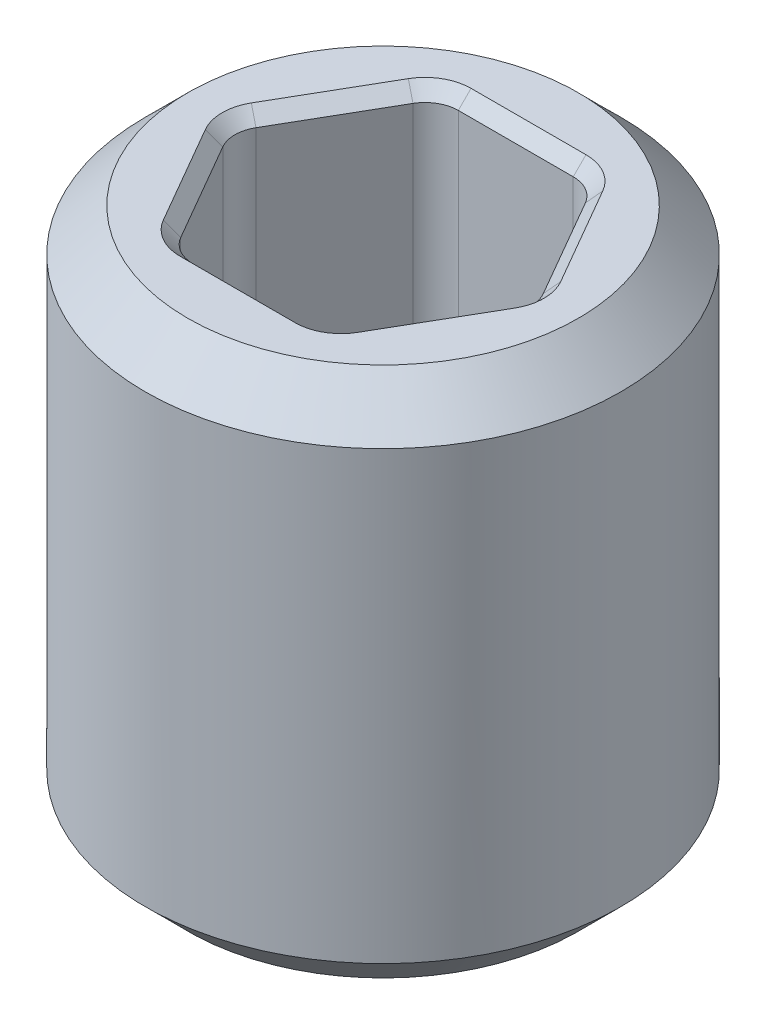
ISO-10303-21;
HEADER;
FILE_DESCRIPTION(('STEP AP214'),'2;1');
FILE_NAME('part.step','',(''),(''),'','','');
FILE_SCHEMA(('AUTOMOTIVE_DESIGN { 1 0 10303 214 1 1 1 1 }'));
ENDSEC;
DATA;
#1=APPLICATION_CONTEXT('core data for automotive mechanical design processes');
#2=APPLICATION_PROTOCOL_DEFINITION('international standard','automotive_design',2000,#1);
#3=PRODUCT_CONTEXT('',#1,'mechanical');
#4=PRODUCT('Part','Part','',(#3));
#5=PRODUCT_RELATED_PRODUCT_CATEGORY('part','',(#4));
#6=PRODUCT_DEFINITION_FORMATION('','',#4);
#7=PRODUCT_DEFINITION_CONTEXT('part definition',#1,'design');
#8=PRODUCT_DEFINITION('design','',#6,#7);
#9=PRODUCT_DEFINITION_SHAPE('','',#8);
#10=(LENGTH_UNIT() NAMED_UNIT(*) SI_UNIT(.MILLI.,.METRE.));
#11=(NAMED_UNIT(*) PLANE_ANGLE_UNIT() SI_UNIT($,.RADIAN.));
#12=(NAMED_UNIT(*) SI_UNIT($,.STERADIAN.) SOLID_ANGLE_UNIT());
#13=UNCERTAINTY_MEASURE_WITH_UNIT(LENGTH_MEASURE(1.E-05),#10,'distance_accuracy_value','');
#14=(GEOMETRIC_REPRESENTATION_CONTEXT(3) GLOBAL_UNCERTAINTY_ASSIGNED_CONTEXT((#13)) GLOBAL_UNIT_ASSIGNED_CONTEXT((#10,
#11,#12)) REPRESENTATION_CONTEXT('',''));
#15=CARTESIAN_POINT('',(0.,0.,0.));
#16=DIRECTION('',(0.,0.,1.));
#17=DIRECTION('',(1.,0.,0.));
#18=AXIS2_PLACEMENT_3D('',#15,#16,#17);
#19=CARTESIAN_POINT('',(0.,-1.5875,0.));
#20=DIRECTION('',(0.,-1.,0.));
#21=DIRECTION('',(0.,0.,-1.));
#22=AXIS2_PLACEMENT_3D('',#19,#20,#21);
#23=PLANE('',#22);
#24=CARTESIAN_POINT('',(0.343703832126949,-1.5875,0.5953125));
#25=DIRECTION('',(0.,-1.,0.));
#26=DIRECTION('',(0.,0.,-1.));
#27=AXIS2_PLACEMENT_3D('',#24,#25,#26);
#28=CIRCLE('',#27,0.2746375);
#29=CARTESIAN_POINT('',(0.343703832126949,-1.5875,0.86995));
#30=VERTEX_POINT('',#29);
#31=CARTESIAN_POINT('',(0.581546883958798,-1.5875,0.73263125));
#32=VERTEX_POINT('',#31);
#33=EDGE_CURVE('E428',#30,#32,#28,.F.);
#34=ORIENTED_EDGE('',*,*,#33,.T.);
#35=DIRECTION('',(0.499999999999999,0.,-0.866025403784439));
#36=VECTOR('',#35,1.);
#37=CARTESIAN_POINT('',(0.925250716085747,-1.5875,0.137318749999999));
#38=LINE('',#37,#36);
#39=CARTESIAN_POINT('',(0.925250716085747,-1.5875,0.137318749999999));
#40=VERTEX_POINT('',#39);
#41=EDGE_CURVE('E432',#32,#40,#38,.T.);
#42=ORIENTED_EDGE('',*,*,#41,.T.);
#43=CARTESIAN_POINT('',(0.687407664253898,-1.5875,0.));
#44=DIRECTION('',(0.,-1.,0.));
#45=DIRECTION('',(0.,0.,-1.));
#46=AXIS2_PLACEMENT_3D('',#43,#44,#45);
#47=CIRCLE('',#46,0.2746375);
#48=CARTESIAN_POINT('',(0.925250716085747,-1.5875,-0.137318750000001));
#49=VERTEX_POINT('',#48);
#50=EDGE_CURVE('E430',#40,#49,#47,.F.);
#51=ORIENTED_EDGE('',*,*,#50,.T.);
#52=DIRECTION('',(-0.5,0.,-0.866025403784439));
#53=VECTOR('',#52,1.);
#54=CARTESIAN_POINT('',(0.581546883958798,-1.5875,-0.73263125));
#55=LINE('',#54,#53);
#56=CARTESIAN_POINT('',(0.581546883958798,-1.5875,-0.73263125));
#57=VERTEX_POINT('',#56);
#58=EDGE_CURVE('E426',#49,#57,#55,.T.);
#59=ORIENTED_EDGE('',*,*,#58,.T.);
#60=CARTESIAN_POINT('',(0.343703832126949,-1.5875,-0.5953125));
#61=DIRECTION('',(0.,-1.,0.));
#62=DIRECTION('',(0.,0.,-1.));
#63=AXIS2_PLACEMENT_3D('',#60,#61,#62);
#64=CIRCLE('',#63,0.2746375);
#65=CARTESIAN_POINT('',(0.343703832126949,-1.5875,-0.86995));
#66=VERTEX_POINT('',#65);
#67=EDGE_CURVE('E418',#57,#66,#64,.F.);
#68=ORIENTED_EDGE('',*,*,#67,.T.);
#69=DIRECTION('',(-1.,0.,0.));
#70=VECTOR('',#69,1.);
#71=CARTESIAN_POINT('',(-0.343703832126949,-1.5875,-0.86995));
#72=LINE('',#71,#70);
#73=CARTESIAN_POINT('',(-0.343703832126949,-1.5875,-0.86995));
#74=VERTEX_POINT('',#73);
#75=EDGE_CURVE('E200',#66,#74,#72,.T.);
#76=ORIENTED_EDGE('',*,*,#75,.T.);
#77=CARTESIAN_POINT('',(-0.343703832126949,-1.5875,-0.5953125));
#78=DIRECTION('',(0.,-1.,0.));
#79=DIRECTION('',(0.,0.,-1.));
#80=AXIS2_PLACEMENT_3D('',#77,#78,#79);
#81=CIRCLE('',#80,0.2746375);
#82=CARTESIAN_POINT('',(-0.581546883958798,-1.5875,-0.73263125));
#83=VERTEX_POINT('',#82);
#84=EDGE_CURVE('E194',#74,#83,#81,.F.);
#85=ORIENTED_EDGE('',*,*,#84,.T.);
#86=DIRECTION('',(-0.499999999999999,0.,0.866025403784439));
#87=VECTOR('',#86,1.);
#88=CARTESIAN_POINT('',(-0.925250716085747,-1.5875,-0.137318749999999));
#89=LINE('',#88,#87);
#90=CARTESIAN_POINT('',(-0.925250716085747,-1.5875,-0.13731875));
#91=VERTEX_POINT('',#90);
#92=EDGE_CURVE('E197',#83,#91,#89,.T.);
#93=ORIENTED_EDGE('',*,*,#92,.T.);
#94=CARTESIAN_POINT('',(-0.687407664253898,-1.5875,0.));
#95=DIRECTION('',(0.,-1.,0.));
#96=DIRECTION('',(0.,0.,-1.));
#97=AXIS2_PLACEMENT_3D('',#94,#95,#96);
#98=CIRCLE('',#97,0.2746375);
#99=CARTESIAN_POINT('',(-0.925250716085747,-1.5875,0.137318750000001));
#100=VERTEX_POINT('',#99);
#101=EDGE_CURVE('E206',#91,#100,#98,.F.);
#102=ORIENTED_EDGE('',*,*,#101,.T.);
#103=DIRECTION('',(0.500000000000001,0.,0.866025403784438));
#104=VECTOR('',#103,1.);
#105=CARTESIAN_POINT('',(-0.581546883958797,-1.5875,0.732631250000001));
#106=LINE('',#105,#104);
#107=CARTESIAN_POINT('',(-0.581546883958797,-1.5875,0.732631250000001));
#108=VERTEX_POINT('',#107);
#109=EDGE_CURVE('E205',#100,#108,#106,.T.);
#110=ORIENTED_EDGE('',*,*,#109,.T.);
#111=CARTESIAN_POINT('',(-0.343703832126948,-1.5875,0.5953125));
#112=DIRECTION('',(0.,-1.,0.));
#113=DIRECTION('',(0.,0.,-1.));
#114=AXIS2_PLACEMENT_3D('',#111,#112,#113);
#115=CIRCLE('',#114,0.2746375);
#116=CARTESIAN_POINT('',(-0.343703832126948,-1.5875,0.86995));
#117=VERTEX_POINT('',#116);
#118=EDGE_CURVE('E416',#108,#117,#115,.F.);
#119=ORIENTED_EDGE('',*,*,#118,.T.);
#120=DIRECTION('',(1.,0.,0.));
#121=VECTOR('',#120,1.);
#122=CARTESIAN_POINT('',(0.343703832126949,-1.5875,0.86995));
#123=LINE('',#122,#121);
#124=EDGE_CURVE('E420',#117,#30,#123,.T.);
#125=ORIENTED_EDGE('',*,*,#124,.T.);
#126=EDGE_LOOP('',(#34,#42,#51,#59,#68,#76,#85,#93,#102,#110,#119,#125));
#127=FACE_BOUND('',#126,.T.);
#128=CARTESIAN_POINT('',(0.,-1.5875,0.));
#129=DIRECTION('',(0.,-1.,0.));
#130=DIRECTION('',(0.,0.,-1.));
#131=AXIS2_PLACEMENT_3D('',#128,#129,#130);
#132=CIRCLE('',#131,1.1684);
#133=CARTESIAN_POINT('',(0.,-1.5875,-1.1684));
#134=VERTEX_POINT('',#133);
#135=EDGE_CURVE('E462',#134,#134,#132,.T.);
#136=ORIENTED_EDGE('',*,*,#135,.T.);
#137=EDGE_LOOP('',(#136));
#138=FACE_BOUND('',#137,.T.);
#139=ADVANCED_FACE('F32',(#127,#138),#23,.T.);
#140=CARTESIAN_POINT('',(0.,-1.70416602917091,0.));
#141=DIRECTION('',(0.,-1.,0.));
#142=DIRECTION('',(0.,0.,-1.));
#143=AXIS2_PLACEMENT_3D('',#140,#141,#142);
#144=CYLINDRICAL_SURFACE('',#143,1.4224);
#145=CARTESIAN_POINT('',(0.,-1.3335,0.));
#146=DIRECTION('',(0.,-1.,0.));
#147=DIRECTION('',(0.,0.,-1.));
#148=AXIS2_PLACEMENT_3D('',#145,#146,#147);
#149=CIRCLE('',#148,1.4224);
#150=CARTESIAN_POINT('',(0.,-1.3335,-1.4224));
#151=VERTEX_POINT('',#150);
#152=EDGE_CURVE('E468',#151,#151,#149,.F.);
#153=ORIENTED_EDGE('',*,*,#152,.T.);
#154=EDGE_LOOP('',(#153));
#155=FACE_BOUND('',#154,.T.);
#156=CARTESIAN_POINT('',(0.,1.3335,0.));
#157=DIRECTION('',(0.,1.,0.));
#158=DIRECTION('',(0.,0.,1.));
#159=AXIS2_PLACEMENT_3D('',#156,#157,#158);
#160=CIRCLE('',#159,1.4224);
#161=CARTESIAN_POINT('',(0.,1.3335,1.4224));
#162=VERTEX_POINT('',#161);
#163=EDGE_CURVE('E465',#162,#162,#160,.F.);
#164=ORIENTED_EDGE('',*,*,#163,.T.);
#165=EDGE_LOOP('',(#164));
#166=FACE_BOUND('',#165,.T.);
#167=ADVANCED_FACE('F551',(#155,#166),#144,.T.);
#168=CARTESIAN_POINT('',(1.4224,1.5875,0.));
#169=DIRECTION('',(0.,1.,0.));
#170=DIRECTION('',(0.,0.,1.));
#171=AXIS2_PLACEMENT_3D('',#168,#169,#170);
#172=PLANE('',#171);
#173=CARTESIAN_POINT('',(0.343703832126949,1.5875,-0.5953125));
#174=DIRECTION('',(0.,1.,0.));
#175=DIRECTION('',(0.,0.,1.));
#176=AXIS2_PLACEMENT_3D('',#173,#174,#175);
#177=CIRCLE('',#176,0.2746375);
#178=CARTESIAN_POINT('',(0.343703832126949,1.5875,-0.86995));
#179=VERTEX_POINT('',#178);
#180=CARTESIAN_POINT('',(0.581546883958798,1.5875,-0.73263125));
#181=VERTEX_POINT('',#180);
#182=EDGE_CURVE('E41',#179,#181,#177,.F.);
#183=ORIENTED_EDGE('',*,*,#182,.T.);
#184=DIRECTION('',(0.5,0.,0.866025403784439));
#185=VECTOR('',#184,1.);
#186=CARTESIAN_POINT('',(0.925250716085747,1.5875,-0.137318750000001));
#187=LINE('',#186,#185);
#188=CARTESIAN_POINT('',(0.925250716085747,1.5875,-0.137318750000001));
#189=VERTEX_POINT('',#188);
#190=EDGE_CURVE('E11',#181,#189,#187,.T.);
#191=ORIENTED_EDGE('',*,*,#190,.T.);
#192=CARTESIAN_POINT('',(0.687407664253898,1.5875,0.));
#193=DIRECTION('',(0.,1.,0.));
#194=DIRECTION('',(0.,0.,1.));
#195=AXIS2_PLACEMENT_3D('',#192,#193,#194);
#196=CIRCLE('',#195,0.2746375);
#197=CARTESIAN_POINT('',(0.925250716085747,1.5875,0.137318749999999));
#198=VERTEX_POINT('',#197);
#199=EDGE_CURVE('E344',#189,#198,#196,.F.);
#200=ORIENTED_EDGE('',*,*,#199,.T.);
#201=DIRECTION('',(-0.499999999999999,0.,0.866025403784439));
#202=VECTOR('',#201,1.);
#203=CARTESIAN_POINT('',(0.581546883958798,1.5875,0.73263125));
#204=LINE('',#203,#202);
#205=CARTESIAN_POINT('',(0.581546883958798,1.5875,0.73263125));
#206=VERTEX_POINT('',#205);
#207=EDGE_CURVE('E340',#198,#206,#204,.T.);
#208=ORIENTED_EDGE('',*,*,#207,.T.);
#209=CARTESIAN_POINT('',(0.343703832126949,1.5875,0.5953125));
#210=DIRECTION('',(0.,1.,0.));
#211=DIRECTION('',(0.,0.,1.));
#212=AXIS2_PLACEMENT_3D('',#209,#210,#211);
#213=CIRCLE('',#212,0.2746375);
#214=CARTESIAN_POINT('',(0.343703832126949,1.5875,0.86995));
#215=VERTEX_POINT('',#214);
#216=EDGE_CURVE('E336',#206,#215,#213,.F.);
#217=ORIENTED_EDGE('',*,*,#216,.T.);
#218=DIRECTION('',(-1.,0.,0.));
#219=VECTOR('',#218,1.);
#220=CARTESIAN_POINT('',(-0.343703832126948,1.5875,0.86995));
#221=LINE('',#220,#219);
#222=CARTESIAN_POINT('',(-0.343703832126948,1.5875,0.869950000000001));
#223=VERTEX_POINT('',#222);
#224=EDGE_CURVE('E332',#215,#223,#221,.T.);
#225=ORIENTED_EDGE('',*,*,#224,.T.);
#226=CARTESIAN_POINT('',(-0.343703832126948,1.5875,0.5953125));
#227=DIRECTION('',(0.,1.,0.));
#228=DIRECTION('',(0.,0.,1.));
#229=AXIS2_PLACEMENT_3D('',#226,#227,#228);
#230=CIRCLE('',#229,0.2746375);
#231=CARTESIAN_POINT('',(-0.581546883958797,1.5875,0.73263125));
#232=VERTEX_POINT('',#231);
#233=EDGE_CURVE('E328',#223,#232,#230,.F.);
#234=ORIENTED_EDGE('',*,*,#233,.T.);
#235=DIRECTION('',(-0.500000000000001,0.,-0.866025403784438));
#236=VECTOR('',#235,1.);
#237=CARTESIAN_POINT('',(-0.925250716085746,1.5875,0.137318750000001));
#238=LINE('',#237,#236);
#239=CARTESIAN_POINT('',(-0.925250716085746,1.5875,0.137318750000001));
#240=VERTEX_POINT('',#239);
#241=EDGE_CURVE('E326',#232,#240,#238,.T.);
#242=ORIENTED_EDGE('',*,*,#241,.T.);
#243=CARTESIAN_POINT('',(-0.687407664253898,1.5875,0.));
#244=DIRECTION('',(0.,1.,0.));
#245=DIRECTION('',(0.,0.,1.));
#246=AXIS2_PLACEMENT_3D('',#243,#244,#245);
#247=CIRCLE('',#246,0.2746375);
#248=CARTESIAN_POINT('',(-0.925250716085747,1.5875,-0.13731875));
#249=VERTEX_POINT('',#248);
#250=EDGE_CURVE('E330',#240,#249,#247,.F.);
#251=ORIENTED_EDGE('',*,*,#250,.T.);
#252=DIRECTION('',(0.499999999999999,0.,-0.866025403784439));
#253=VECTOR('',#252,1.);
#254=CARTESIAN_POINT('',(-0.581546883958798,1.5875,-0.73263125));
#255=LINE('',#254,#253);
#256=CARTESIAN_POINT('',(-0.581546883958799,1.5875,-0.73263125));
#257=VERTEX_POINT('',#256);
#258=EDGE_CURVE('E334',#249,#257,#255,.T.);
#259=ORIENTED_EDGE('',*,*,#258,.T.);
#260=CARTESIAN_POINT('',(-0.343703832126949,1.5875,-0.5953125));
#261=DIRECTION('',(0.,1.,0.));
#262=DIRECTION('',(0.,0.,1.));
#263=AXIS2_PLACEMENT_3D('',#260,#261,#262);
#264=CIRCLE('',#263,0.2746375);
#265=CARTESIAN_POINT('',(-0.343703832126949,1.5875,-0.869950000000001));
#266=VERTEX_POINT('',#265);
#267=EDGE_CURVE('E338',#257,#266,#264,.F.);
#268=ORIENTED_EDGE('',*,*,#267,.T.);
#269=DIRECTION('',(1.,0.,0.));
#270=VECTOR('',#269,1.);
#271=CARTESIAN_POINT('',(0.343703832126949,1.5875,-0.86995));
#272=LINE('',#271,#270);
#273=EDGE_CURVE('E342',#266,#179,#272,.T.);
#274=ORIENTED_EDGE('',*,*,#273,.T.);
#275=EDGE_LOOP('',(#183,#191,#200,#208,#217,#225,#234,#242,#251,#259,#268,#274));
#276=FACE_BOUND('',#275,.T.);
#277=CARTESIAN_POINT('',(0.,1.5875,0.));
#278=DIRECTION('',(0.,1.,0.));
#279=DIRECTION('',(0.,0.,1.));
#280=AXIS2_PLACEMENT_3D('',#277,#278,#279);
#281=CIRCLE('',#280,1.1684);
#282=CARTESIAN_POINT('',(0.,1.5875,1.1684));
#283=VERTEX_POINT('',#282);
#284=EDGE_CURVE('E217',#283,#283,#281,.T.);
#285=ORIENTED_EDGE('',*,*,#284,.T.);
#286=EDGE_LOOP('',(#285));
#287=FACE_BOUND('',#286,.T.);
#288=ADVANCED_FACE('F346',(#276,#287),#172,.T.);
#289=CARTESIAN_POINT('',(0.91654355233853,-1.5875,0.));
#290=DIRECTION('',(0.866025403784439,0.,-0.5));
#291=DIRECTION('',(-0.5,0.,-0.866025403784439));
#292=AXIS2_PLACEMENT_3D('',#289,#290,#291);
#293=PLANE('',#292);
#294=DIRECTION('',(0.,1.,0.));
#295=VECTOR('',#294,1.);
#296=CARTESIAN_POINT('',(0.515555748190423,-1.5875,-0.69453125));
#297=LINE('',#296,#295);
#298=CARTESIAN_POINT('',(0.515555748190423,1.5113,-0.69453125));
#299=VERTEX_POINT('',#298);
#300=CARTESIAN_POINT('',(0.515555748190423,-1.5113,-0.69453125));
#301=VERTEX_POINT('',#300);
#302=EDGE_CURVE('E223',#299,#301,#297,.F.);
#303=ORIENTED_EDGE('',*,*,#302,.T.);
#304=DIRECTION('',(0.5,0.,0.866025403784439));
#305=VECTOR('',#304,1.);
#306=CARTESIAN_POINT('',(0.859259580317372,-1.5113,-0.0992187500000007));
#307=LINE('',#306,#305);
#308=CARTESIAN_POINT('',(0.859259580317372,-1.5113,-0.0992187500000007));
#309=VERTEX_POINT('',#308);
#310=EDGE_CURVE('E378',#301,#309,#307,.T.);
#311=ORIENTED_EDGE('',*,*,#310,.T.);
#312=DIRECTION('',(0.,1.,0.));
#313=VECTOR('',#312,1.);
#314=CARTESIAN_POINT('',(0.859259580317372,1.5875,-0.0992187500000007));
#315=LINE('',#314,#313);
#316=CARTESIAN_POINT('',(0.859259580317372,1.5113,-0.0992187500000007));
#317=VERTEX_POINT('',#316);
#318=EDGE_CURVE('E446',#309,#317,#315,.T.);
#319=ORIENTED_EDGE('',*,*,#318,.T.);
#320=DIRECTION('',(-0.5,0.,-0.866025403784439));
#321=VECTOR('',#320,1.);
#322=CARTESIAN_POINT('',(0.515555748190423,1.5113,-0.69453125));
#323=LINE('',#322,#321);
#324=EDGE_CURVE('E375',#317,#299,#323,.T.);
#325=ORIENTED_EDGE('',*,*,#324,.T.);
#326=EDGE_LOOP('',(#303,#311,#319,#325));
#327=FACE_BOUND('',#326,.T.);
#328=ADVANCED_FACE('F530',(#327),#293,.F.);
#329=CARTESIAN_POINT('',(0.458271776169266,-1.5875,0.79375));
#330=DIRECTION('',(0.866025403784439,0.,0.499999999999999));
#331=DIRECTION('',(0.499999999999999,0.,-0.866025403784439));
#332=AXIS2_PLACEMENT_3D('',#329,#330,#331);
#333=PLANE('',#332);
#334=DIRECTION('',(0.,1.,0.));
#335=VECTOR('',#334,1.);
#336=CARTESIAN_POINT('',(0.859259580317372,-1.5875,0.0992187499999992));
#337=LINE('',#336,#335);
#338=CARTESIAN_POINT('',(0.859259580317372,1.5113,0.0992187499999992));
#339=VERTEX_POINT('',#338);
#340=CARTESIAN_POINT('',(0.859259580317372,-1.5113,0.0992187499999992));
#341=VERTEX_POINT('',#340);
#342=EDGE_CURVE('E438',#339,#341,#337,.F.);
#343=ORIENTED_EDGE('',*,*,#342,.T.);
#344=DIRECTION('',(-0.499999999999999,0.,0.866025403784439));
#345=VECTOR('',#344,1.);
#346=CARTESIAN_POINT('',(0.515555748190424,-1.5113,0.69453125));
#347=LINE('',#346,#345);
#348=CARTESIAN_POINT('',(0.515555748190424,-1.5113,0.69453125));
#349=VERTEX_POINT('',#348);
#350=EDGE_CURVE('E363',#341,#349,#347,.T.);
#351=ORIENTED_EDGE('',*,*,#350,.T.);
#352=DIRECTION('',(0.,1.,0.));
#353=VECTOR('',#352,1.);
#354=CARTESIAN_POINT('',(0.515555748190424,1.5875,0.69453125));
#355=LINE('',#354,#353);
#356=CARTESIAN_POINT('',(0.515555748190424,1.5113,0.69453125));
#357=VERTEX_POINT('',#356);
#358=EDGE_CURVE('E440',#349,#357,#355,.T.);
#359=ORIENTED_EDGE('',*,*,#358,.T.);
#360=DIRECTION('',(0.499999999999999,0.,-0.866025403784439));
#361=VECTOR('',#360,1.);
#362=CARTESIAN_POINT('',(0.859259580317372,1.5113,0.0992187499999991));
#363=LINE('',#362,#361);
#364=EDGE_CURVE('E368',#357,#339,#363,.T.);
#365=ORIENTED_EDGE('',*,*,#364,.T.);
#366=EDGE_LOOP('',(#343,#351,#359,#365));
#367=FACE_BOUND('',#366,.T.);
#368=ADVANCED_FACE('F437',(#367),#333,.F.);
#369=CARTESIAN_POINT('',(-0.458271776169265,-1.5875,0.79375));
#370=DIRECTION('',(0.,0.,1.));
#371=DIRECTION('',(1.,0.,0.));
#372=AXIS2_PLACEMENT_3D('',#369,#370,#371);
#373=PLANE('',#372);
#374=DIRECTION('',(0.,1.,0.));
#375=VECTOR('',#374,1.);
#376=CARTESIAN_POINT('',(0.343703832126949,-1.5875,0.79375));
#377=LINE('',#376,#375);
#378=CARTESIAN_POINT('',(0.343703832126949,1.5113,0.79375));
#379=VERTEX_POINT('',#378);
#380=CARTESIAN_POINT('',(0.343703832126949,-1.5113,0.79375));
#381=VERTEX_POINT('',#380);
#382=EDGE_CURVE('E444',#379,#381,#377,.F.);
#383=ORIENTED_EDGE('',*,*,#382,.T.);
#384=DIRECTION('',(-1.,0.,0.));
#385=VECTOR('',#384,1.);
#386=CARTESIAN_POINT('',(-0.343703832126948,-1.5113,0.79375));
#387=LINE('',#386,#385);
#388=CARTESIAN_POINT('',(-0.343703832126948,-1.5113,0.79375));
#389=VERTEX_POINT('',#388);
#390=EDGE_CURVE('E382',#381,#389,#387,.T.);
#391=ORIENTED_EDGE('',*,*,#390,.T.);
#392=DIRECTION('',(0.,1.,0.));
#393=VECTOR('',#392,1.);
#394=CARTESIAN_POINT('',(-0.343703832126948,1.5875,0.79375));
#395=LINE('',#394,#393);
#396=CARTESIAN_POINT('',(-0.343703832126948,1.5113,0.79375));
#397=VERTEX_POINT('',#396);
#398=EDGE_CURVE('E397',#389,#397,#395,.T.);
#399=ORIENTED_EDGE('',*,*,#398,.T.);
#400=DIRECTION('',(1.,0.,0.));
#401=VECTOR('',#400,1.);
#402=CARTESIAN_POINT('',(0.343703832126949,1.5113,0.79375));
#403=LINE('',#402,#401);
#404=EDGE_CURVE('E380',#397,#379,#403,.T.);
#405=ORIENTED_EDGE('',*,*,#404,.T.);
#406=EDGE_LOOP('',(#383,#391,#399,#405));
#407=FACE_BOUND('',#406,.T.);
#408=ADVANCED_FACE('F502',(#407),#373,.F.);
#409=CARTESIAN_POINT('',(-0.916543552338531,-1.5875,0.));
#410=DIRECTION('',(-0.866025403784438,0.,0.500000000000001));
#411=DIRECTION('',(0.500000000000001,0.,0.866025403784438));
#412=AXIS2_PLACEMENT_3D('',#409,#410,#411);
#413=PLANE('',#412);
#414=DIRECTION('',(0.,1.,0.));
#415=VECTOR('',#414,1.);
#416=CARTESIAN_POINT('',(-0.515555748190423,-1.5875,0.69453125));
#417=LINE('',#416,#415);
#418=CARTESIAN_POINT('',(-0.515555748190423,1.5113,0.69453125));
#419=VERTEX_POINT('',#418);
#420=CARTESIAN_POINT('',(-0.515555748190423,-1.5113,0.69453125));
#421=VERTEX_POINT('',#420);
#422=EDGE_CURVE('E395',#419,#421,#417,.F.);
#423=ORIENTED_EDGE('',*,*,#422,.T.);
#424=DIRECTION('',(-0.500000000000001,0.,-0.866025403784438));
#425=VECTOR('',#424,1.);
#426=CARTESIAN_POINT('',(-0.859259580317372,-1.5113,0.0992187500000006));
#427=LINE('',#426,#425);
#428=CARTESIAN_POINT('',(-0.859259580317372,-1.5113,0.0992187500000006));
#429=VERTEX_POINT('',#428);
#430=EDGE_CURVE('E308',#421,#429,#427,.T.);
#431=ORIENTED_EDGE('',*,*,#430,.T.);
#432=DIRECTION('',(0.,1.,0.));
#433=VECTOR('',#432,1.);
#434=CARTESIAN_POINT('',(-0.859259580317372,1.5875,0.0992187500000006));
#435=LINE('',#434,#433);
#436=CARTESIAN_POINT('',(-0.859259580317372,1.5113,0.0992187500000006));
#437=VERTEX_POINT('',#436);
#438=EDGE_CURVE('E407',#429,#437,#435,.T.);
#439=ORIENTED_EDGE('',*,*,#438,.T.);
#440=DIRECTION('',(0.500000000000001,0.,0.866025403784438));
#441=VECTOR('',#440,1.);
#442=CARTESIAN_POINT('',(-0.515555748190423,1.5113,0.69453125));
#443=LINE('',#442,#441);
#444=EDGE_CURVE('E305',#437,#419,#443,.T.);
#445=ORIENTED_EDGE('',*,*,#444,.T.);
#446=EDGE_LOOP('',(#423,#431,#439,#445));
#447=FACE_BOUND('',#446,.T.);
#448=ADVANCED_FACE('F402',(#447),#413,.F.);
#449=CARTESIAN_POINT('',(-0.458271776169266,-1.5875,-0.79375));
#450=DIRECTION('',(-0.866025403784439,0.,-0.499999999999999));
#451=DIRECTION('',(-0.499999999999999,0.,0.866025403784439));
#452=AXIS2_PLACEMENT_3D('',#449,#450,#451);
#453=PLANE('',#452);
#454=DIRECTION('',(0.,1.,0.));
#455=VECTOR('',#454,1.);
#456=CARTESIAN_POINT('',(-0.859259580317372,-1.5875,-0.0992187499999994));
#457=LINE('',#456,#455);
#458=CARTESIAN_POINT('',(-0.859259580317372,1.5113,-0.0992187499999994));
#459=VERTEX_POINT('',#458);
#460=CARTESIAN_POINT('',(-0.859259580317372,-1.5113,-0.0992187499999994));
#461=VERTEX_POINT('',#460);
#462=EDGE_CURVE('E455',#459,#461,#457,.F.);
#463=ORIENTED_EDGE('',*,*,#462,.T.);
#464=DIRECTION('',(0.499999999999999,0.,-0.866025403784439));
#465=VECTOR('',#464,1.);
#466=CARTESIAN_POINT('',(-0.515555748190424,-1.5113,-0.69453125));
#467=LINE('',#466,#465);
#468=CARTESIAN_POINT('',(-0.515555748190424,-1.5113,-0.69453125));
#469=VERTEX_POINT('',#468);
#470=EDGE_CURVE('E324',#461,#469,#467,.T.);
#471=ORIENTED_EDGE('',*,*,#470,.T.);
#472=DIRECTION('',(0.,1.,0.));
#473=VECTOR('',#472,1.);
#474=CARTESIAN_POINT('',(-0.515555748190424,1.5875,-0.69453125));
#475=LINE('',#474,#473);
#476=CARTESIAN_POINT('',(-0.515555748190424,1.5113,-0.69453125));
#477=VERTEX_POINT('',#476);
#478=EDGE_CURVE('E406',#469,#477,#475,.T.);
#479=ORIENTED_EDGE('',*,*,#478,.T.);
#480=DIRECTION('',(-0.499999999999999,0.,0.866025403784439));
#481=VECTOR('',#480,1.);
#482=CARTESIAN_POINT('',(-0.859259580317372,1.5113,-0.0992187499999994));
#483=LINE('',#482,#481);
#484=EDGE_CURVE('E322',#477,#459,#483,.T.);
#485=ORIENTED_EDGE('',*,*,#484,.T.);
#486=EDGE_LOOP('',(#463,#471,#479,#485));
#487=FACE_BOUND('',#486,.T.);
#488=ADVANCED_FACE('F480',(#487),#453,.F.);
#489=CARTESIAN_POINT('',(0.458271776169265,-1.5875,-0.79375));
#490=DIRECTION('',(0.,0.,-1.));
#491=DIRECTION('',(-1.,0.,0.));
#492=AXIS2_PLACEMENT_3D('',#489,#490,#491);
#493=PLANE('',#492);
#494=DIRECTION('',(0.,1.,0.));
#495=VECTOR('',#494,1.);
#496=CARTESIAN_POINT('',(-0.343703832126949,-1.5875,-0.79375));
#497=LINE('',#496,#495);
#498=CARTESIAN_POINT('',(-0.343703832126949,1.5113,-0.79375));
#499=VERTEX_POINT('',#498);
#500=CARTESIAN_POINT('',(-0.343703832126949,-1.5113,-0.79375));
#501=VERTEX_POINT('',#500);
#502=EDGE_CURVE('E460',#499,#501,#497,.F.);
#503=ORIENTED_EDGE('',*,*,#502,.T.);
#504=DIRECTION('',(1.,0.,0.));
#505=VECTOR('',#504,1.);
#506=CARTESIAN_POINT('',(0.343703832126949,-1.5113,-0.79375));
#507=LINE('',#506,#505);
#508=CARTESIAN_POINT('',(0.343703832126949,-1.5113,-0.79375));
#509=VERTEX_POINT('',#508);
#510=EDGE_CURVE('E299',#501,#509,#507,.T.);
#511=ORIENTED_EDGE('',*,*,#510,.T.);
#512=DIRECTION('',(0.,1.,0.));
#513=VECTOR('',#512,1.);
#514=CARTESIAN_POINT('',(0.343703832126949,1.5875,-0.79375));
#515=LINE('',#514,#513);
#516=CARTESIAN_POINT('',(0.343703832126949,1.5113,-0.79375));
#517=VERTEX_POINT('',#516);
#518=EDGE_CURVE('E458',#509,#517,#515,.T.);
#519=ORIENTED_EDGE('',*,*,#518,.T.);
#520=DIRECTION('',(-1.,0.,0.));
#521=VECTOR('',#520,1.);
#522=CARTESIAN_POINT('',(-0.343703832126949,1.5113,-0.79375));
#523=LINE('',#522,#521);
#524=EDGE_CURVE('E306',#517,#499,#523,.T.);
#525=ORIENTED_EDGE('',*,*,#524,.T.);
#526=EDGE_LOOP('',(#503,#511,#519,#525));
#527=FACE_BOUND('',#526,.T.);
#528=ADVANCED_FACE('F538',(#527),#493,.F.);
#529=CARTESIAN_POINT('',(0.687407664253898,-1.5875,0.));
#530=DIRECTION('',(0.,-1.,0.));
#531=DIRECTION('',(0.,0.,-1.));
#532=AXIS2_PLACEMENT_3D('',#529,#530,#531);
#533=CYLINDRICAL_SURFACE('',#532,0.1984375);
#534=ORIENTED_EDGE('',*,*,#318,.F.);
#535=CARTESIAN_POINT('',(0.687407664253898,-1.5113,0.));
#536=DIRECTION('',(0.,-1.,0.));
#537=DIRECTION('',(0.,0.,-1.));
#538=AXIS2_PLACEMENT_3D('',#535,#536,#537);
#539=CIRCLE('',#538,0.1984375);
#540=EDGE_CURVE('E362',#309,#341,#539,.T.);
#541=ORIENTED_EDGE('',*,*,#540,.T.);
#542=ORIENTED_EDGE('',*,*,#342,.F.);
#543=CARTESIAN_POINT('',(0.687407664253898,1.5113,0.));
#544=DIRECTION('',(0.,1.,0.));
#545=DIRECTION('',(0.,0.,1.));
#546=AXIS2_PLACEMENT_3D('',#543,#544,#545);
#547=CIRCLE('',#546,0.1984375);
#548=EDGE_CURVE('E357',#339,#317,#547,.T.);
#549=ORIENTED_EDGE('',*,*,#548,.T.);
#550=EDGE_LOOP('',(#534,#541,#542,#549));
#551=FACE_BOUND('',#550,.T.);
#552=ADVANCED_FACE('F441',(#551),#533,.F.);
#553=CARTESIAN_POINT('',(0.343703832126949,-1.5875,0.5953125));
#554=DIRECTION('',(0.,-1.,0.));
#555=DIRECTION('',(0.,0.,-1.));
#556=AXIS2_PLACEMENT_3D('',#553,#554,#555);
#557=CYLINDRICAL_SURFACE('',#556,0.1984375);
#558=ORIENTED_EDGE('',*,*,#358,.F.);
#559=CARTESIAN_POINT('',(0.343703832126949,-1.5113,0.5953125));
#560=DIRECTION('',(0.,-1.,0.));
#561=DIRECTION('',(0.,0.,-1.));
#562=AXIS2_PLACEMENT_3D('',#559,#560,#561);
#563=CIRCLE('',#562,0.1984375);
#564=EDGE_CURVE('E373',#349,#381,#563,.T.);
#565=ORIENTED_EDGE('',*,*,#564,.T.);
#566=ORIENTED_EDGE('',*,*,#382,.F.);
#567=CARTESIAN_POINT('',(0.343703832126949,1.5113,0.5953125));
#568=DIRECTION('',(0.,1.,0.));
#569=DIRECTION('',(0.,0.,1.));
#570=AXIS2_PLACEMENT_3D('',#567,#568,#569);
#571=CIRCLE('',#570,0.1984375);
#572=EDGE_CURVE('E365',#379,#357,#571,.T.);
#573=ORIENTED_EDGE('',*,*,#572,.T.);
#574=EDGE_LOOP('',(#558,#565,#566,#573));
#575=FACE_BOUND('',#574,.T.);
#576=ADVANCED_FACE('F562',(#575),#557,.F.);
#577=CARTESIAN_POINT('',(-0.343703832126948,-1.5875,0.5953125));
#578=DIRECTION('',(0.,-1.,0.));
#579=DIRECTION('',(0.,0.,-1.));
#580=AXIS2_PLACEMENT_3D('',#577,#578,#579);
#581=CYLINDRICAL_SURFACE('',#580,0.1984375);
#582=ORIENTED_EDGE('',*,*,#398,.F.);
#583=CARTESIAN_POINT('',(-0.343703832126948,-1.5113,0.5953125));
#584=DIRECTION('',(0.,-1.,0.));
#585=DIRECTION('',(0.,0.,-1.));
#586=AXIS2_PLACEMENT_3D('',#583,#584,#585);
#587=CIRCLE('',#586,0.1984375);
#588=EDGE_CURVE('E310',#389,#421,#587,.T.);
#589=ORIENTED_EDGE('',*,*,#588,.T.);
#590=ORIENTED_EDGE('',*,*,#422,.F.);
#591=CARTESIAN_POINT('',(-0.343703832126948,1.5113,0.5953125));
#592=DIRECTION('',(0.,1.,0.));
#593=DIRECTION('',(0.,0.,1.));
#594=AXIS2_PLACEMENT_3D('',#591,#592,#593);
#595=CIRCLE('',#594,0.1984375);
#596=EDGE_CURVE('E388',#419,#397,#595,.T.);
#597=ORIENTED_EDGE('',*,*,#596,.T.);
#598=EDGE_LOOP('',(#582,#589,#590,#597));
#599=FACE_BOUND('',#598,.T.);
#600=ADVANCED_FACE('F394',(#599),#581,.F.);
#601=CARTESIAN_POINT('',(-0.687407664253898,-1.5875,0.));
#602=DIRECTION('',(0.,-1.,0.));
#603=DIRECTION('',(0.,0.,-1.));
#604=AXIS2_PLACEMENT_3D('',#601,#602,#603);
#605=CYLINDRICAL_SURFACE('',#604,0.1984375);
#606=ORIENTED_EDGE('',*,*,#438,.F.);
#607=CARTESIAN_POINT('',(-0.687407664253898,-1.5113,0.));
#608=DIRECTION('',(0.,-1.,0.));
#609=DIRECTION('',(0.,0.,-1.));
#610=AXIS2_PLACEMENT_3D('',#607,#608,#609);
#611=CIRCLE('',#610,0.1984375);
#612=EDGE_CURVE('E320',#429,#461,#611,.T.);
#613=ORIENTED_EDGE('',*,*,#612,.T.);
#614=ORIENTED_EDGE('',*,*,#462,.F.);
#615=CARTESIAN_POINT('',(-0.687407664253898,1.5113,0.));
#616=DIRECTION('',(0.,1.,0.));
#617=DIRECTION('',(0.,0.,1.));
#618=AXIS2_PLACEMENT_3D('',#615,#616,#617);
#619=CIRCLE('',#618,0.1984375);
#620=EDGE_CURVE('E318',#459,#437,#619,.T.);
#621=ORIENTED_EDGE('',*,*,#620,.T.);
#622=EDGE_LOOP('',(#606,#613,#614,#621));
#623=FACE_BOUND('',#622,.T.);
#624=ADVANCED_FACE('F478',(#623),#605,.F.);
#625=CARTESIAN_POINT('',(-0.343703832126949,-1.5875,-0.5953125));
#626=DIRECTION('',(0.,-1.,0.));
#627=DIRECTION('',(0.,0.,-1.));
#628=AXIS2_PLACEMENT_3D('',#625,#626,#627);
#629=CYLINDRICAL_SURFACE('',#628,0.1984375);
#630=ORIENTED_EDGE('',*,*,#478,.F.);
#631=CARTESIAN_POINT('',(-0.343703832126949,-1.5113,-0.5953125));
#632=DIRECTION('',(0.,-1.,0.));
#633=DIRECTION('',(0.,0.,-1.));
#634=AXIS2_PLACEMENT_3D('',#631,#632,#633);
#635=CIRCLE('',#634,0.1984375);
#636=EDGE_CURVE('E220',#469,#501,#635,.T.);
#637=ORIENTED_EDGE('',*,*,#636,.T.);
#638=ORIENTED_EDGE('',*,*,#502,.F.);
#639=CARTESIAN_POINT('',(-0.343703832126949,1.5113,-0.5953125));
#640=DIRECTION('',(0.,1.,0.));
#641=DIRECTION('',(0.,0.,1.));
#642=AXIS2_PLACEMENT_3D('',#639,#640,#641);
#643=CIRCLE('',#642,0.1984375);
#644=EDGE_CURVE('E315',#499,#477,#643,.T.);
#645=ORIENTED_EDGE('',*,*,#644,.T.);
#646=EDGE_LOOP('',(#630,#637,#638,#645));
#647=FACE_BOUND('',#646,.T.);
#648=ADVANCED_FACE('F570',(#647),#629,.F.);
#649=CARTESIAN_POINT('',(0.343703832126949,-1.5875,-0.5953125));
#650=DIRECTION('',(0.,-1.,0.));
#651=DIRECTION('',(0.,0.,-1.));
#652=AXIS2_PLACEMENT_3D('',#649,#650,#651);
#653=CYLINDRICAL_SURFACE('',#652,0.1984375);
#654=ORIENTED_EDGE('',*,*,#518,.F.);
#655=CARTESIAN_POINT('',(0.343703832126949,-1.5113,-0.5953125));
#656=DIRECTION('',(0.,-1.,0.));
#657=DIRECTION('',(0.,0.,-1.));
#658=AXIS2_PLACEMENT_3D('',#655,#656,#657);
#659=CIRCLE('',#658,0.1984375);
#660=EDGE_CURVE('E386',#509,#301,#659,.T.);
#661=ORIENTED_EDGE('',*,*,#660,.T.);
#662=ORIENTED_EDGE('',*,*,#302,.F.);
#663=CARTESIAN_POINT('',(0.343703832126949,1.5113,-0.5953125));
#664=DIRECTION('',(0.,1.,0.));
#665=DIRECTION('',(0.,0.,1.));
#666=AXIS2_PLACEMENT_3D('',#663,#664,#665);
#667=CIRCLE('',#666,0.1984375);
#668=EDGE_CURVE('E384',#299,#517,#667,.T.);
#669=ORIENTED_EDGE('',*,*,#668,.T.);
#670=EDGE_LOOP('',(#654,#661,#662,#669));
#671=FACE_BOUND('',#670,.T.);
#672=ADVANCED_FACE('F528',(#671),#653,.F.);
#673=CARTESIAN_POINT('',(0.,-1.5875,0.));
#674=DIRECTION('',(0.,1.,0.));
#675=DIRECTION('',(0.,0.,1.));
#676=AXIS2_PLACEMENT_3D('',#673,#674,#675);
#677=CONICAL_SURFACE('',#676,1.1684,0.785398163397446);
#678=ORIENTED_EDGE('',*,*,#152,.F.);
#679=EDGE_LOOP('',(#678));
#680=FACE_BOUND('',#679,.T.);
#681=ORIENTED_EDGE('',*,*,#135,.F.);
#682=EDGE_LOOP('',(#681));
#683=FACE_BOUND('',#682,.T.);
#684=ADVANCED_FACE('F576',(#680,#683),#677,.T.);
#685=CARTESIAN_POINT('',(0.,1.3335,0.));
#686=DIRECTION('',(0.,-1.,0.));
#687=DIRECTION('',(0.,0.,-1.));
#688=AXIS2_PLACEMENT_3D('',#685,#686,#687);
#689=CONICAL_SURFACE('',#688,1.4224,0.78539816339745);
#690=ORIENTED_EDGE('',*,*,#284,.F.);
#691=EDGE_LOOP('',(#690));
#692=FACE_BOUND('',#691,.T.);
#693=ORIENTED_EDGE('',*,*,#163,.F.);
#694=EDGE_LOOP('',(#693));
#695=FACE_BOUND('',#694,.T.);
#696=ADVANCED_FACE('F579',(#692,#695),#689,.T.);
#697=CARTESIAN_POINT('',(-0.753398800022273,-1.5875,-0.434975));
#698=DIRECTION('',(0.612372435695795,-0.707106781186548,0.353553390593273));
#699=DIRECTION('',(0.499999999999999,0.,-0.866025403784439));
#700=AXIS2_PLACEMENT_3D('',#697,#698,#699);
#701=PLANE('',#700);
#702=DIRECTION('',(-0.612372435695796,-0.707106781186547,-0.353553390593273));
#703=VECTOR('',#702,1.);
#704=CARTESIAN_POINT('',(-0.515555748190424,-1.5113,-0.69453125));
#705=LINE('',#704,#703);
#706=EDGE_CURVE('E212',#469,#83,#705,.T.);
#707=ORIENTED_EDGE('',*,*,#706,.F.);
#708=ORIENTED_EDGE('',*,*,#470,.F.);
#709=DIRECTION('',(0.612372435695795,0.707106781186547,0.353553390593273));
#710=VECTOR('',#709,1.);
#711=CARTESIAN_POINT('',(-0.925250716085747,-1.5875,-0.13731875));
#712=LINE('',#711,#710);
#713=EDGE_CURVE('E215',#91,#461,#712,.T.);
#714=ORIENTED_EDGE('',*,*,#713,.F.);
#715=ORIENTED_EDGE('',*,*,#92,.F.);
#716=EDGE_LOOP('',(#707,#708,#714,#715));
#717=FACE_BOUND('',#716,.T.);
#718=ADVANCED_FACE('F210',(#717),#701,.T.);
#719=CARTESIAN_POINT('',(-0.687407664253898,-1.5875,0.));
#720=DIRECTION('',(0.,-1.,0.));
#721=DIRECTION('',(0.,0.,-1.));
#722=AXIS2_PLACEMENT_3D('',#719,#720,#721);
#723=CONICAL_SURFACE('',#722,0.2746375,0.785398163397448);
#724=ORIENTED_EDGE('',*,*,#713,.T.);
#725=ORIENTED_EDGE('',*,*,#612,.F.);
#726=DIRECTION('',(0.612372435695794,0.707106781186548,-0.353553390593274));
#727=VECTOR('',#726,1.);
#728=CARTESIAN_POINT('',(-0.925250716085747,-1.5875,0.137318750000001));
#729=LINE('',#728,#727);
#730=EDGE_CURVE('E221',#100,#429,#729,.T.);
#731=ORIENTED_EDGE('',*,*,#730,.F.);
#732=ORIENTED_EDGE('',*,*,#101,.F.);
#733=EDGE_LOOP('',(#724,#725,#731,#732));
#734=FACE_BOUND('',#733,.T.);
#735=ADVANCED_FACE('F475',(#734),#723,.F.);
#736=CARTESIAN_POINT('',(-0.343703832126949,-1.5875,-0.5953125));
#737=DIRECTION('',(0.,-1.,0.));
#738=DIRECTION('',(0.,0.,-1.));
#739=AXIS2_PLACEMENT_3D('',#736,#737,#738);
#740=CONICAL_SURFACE('',#739,0.2746375,0.785398163397448);
#741=ORIENTED_EDGE('',*,*,#706,.T.);
#742=ORIENTED_EDGE('',*,*,#84,.F.);
#743=DIRECTION('',(0.,-0.707106781186547,-0.707106781186547));
#744=VECTOR('',#743,1.);
#745=CARTESIAN_POINT('',(-0.343703832126949,-1.5113,-0.79375));
#746=LINE('',#745,#744);
#747=EDGE_CURVE('E226',#501,#74,#746,.T.);
#748=ORIENTED_EDGE('',*,*,#747,.F.);
#749=ORIENTED_EDGE('',*,*,#636,.F.);
#750=EDGE_LOOP('',(#741,#742,#748,#749));
#751=FACE_BOUND('',#750,.T.);
#752=ADVANCED_FACE('F219',(#751),#740,.F.);
#753=CARTESIAN_POINT('',(-0.753398800022272,-1.5875,0.434975000000001));
#754=DIRECTION('',(0.612372435695795,-0.707106781186547,-0.353553390593274));
#755=DIRECTION('',(-0.500000000000001,0.,-0.866025403784438));
#756=AXIS2_PLACEMENT_3D('',#753,#754,#755);
#757=PLANE('',#756);
#758=ORIENTED_EDGE('',*,*,#730,.T.);
#759=ORIENTED_EDGE('',*,*,#430,.F.);
#760=DIRECTION('',(0.612372435695793,0.707106781186548,-0.353553390593274));
#761=VECTOR('',#760,1.);
#762=CARTESIAN_POINT('',(-0.581546883958797,-1.5875,0.732631250000001));
#763=LINE('',#762,#761);
#764=EDGE_CURVE('E293',#108,#421,#763,.T.);
#765=ORIENTED_EDGE('',*,*,#764,.F.);
#766=ORIENTED_EDGE('',*,*,#109,.F.);
#767=EDGE_LOOP('',(#758,#759,#765,#766));
#768=FACE_BOUND('',#767,.T.);
#769=ADVANCED_FACE('F411',(#768),#757,.T.);
#770=CARTESIAN_POINT('',(0.,-1.5875,-0.86995));
#771=DIRECTION('',(0.,-0.707106781186547,0.707106781186548));
#772=DIRECTION('',(1.,0.,0.));
#773=AXIS2_PLACEMENT_3D('',#770,#771,#772);
#774=PLANE('',#773);
#775=ORIENTED_EDGE('',*,*,#747,.T.);
#776=ORIENTED_EDGE('',*,*,#75,.F.);
#777=DIRECTION('',(0.,-0.707106781186547,-0.707106781186547));
#778=VECTOR('',#777,1.);
#779=CARTESIAN_POINT('',(0.343703832126949,-1.5113,-0.79375));
#780=LINE('',#779,#778);
#781=EDGE_CURVE('E290',#509,#66,#780,.T.);
#782=ORIENTED_EDGE('',*,*,#781,.F.);
#783=ORIENTED_EDGE('',*,*,#510,.F.);
#784=EDGE_LOOP('',(#775,#776,#782,#783));
#785=FACE_BOUND('',#784,.T.);
#786=ADVANCED_FACE('F297',(#785),#774,.T.);
#787=CARTESIAN_POINT('',(-0.343703832126948,-1.5875,0.5953125));
#788=DIRECTION('',(0.,-1.,0.));
#789=DIRECTION('',(0.,0.,-1.));
#790=AXIS2_PLACEMENT_3D('',#787,#788,#789);
#791=CONICAL_SURFACE('',#790,0.2746375,0.785398163397448);
#792=ORIENTED_EDGE('',*,*,#764,.T.);
#793=ORIENTED_EDGE('',*,*,#588,.F.);
#794=DIRECTION('',(0.,0.707106781186547,-0.707106781186547));
#795=VECTOR('',#794,1.);
#796=CARTESIAN_POINT('',(-0.343703832126948,-1.5875,0.86995));
#797=LINE('',#796,#795);
#798=EDGE_CURVE('E287',#117,#389,#797,.T.);
#799=ORIENTED_EDGE('',*,*,#798,.F.);
#800=ORIENTED_EDGE('',*,*,#118,.F.);
#801=EDGE_LOOP('',(#792,#793,#799,#800));
#802=FACE_BOUND('',#801,.T.);
#803=ADVANCED_FACE('F415',(#802),#791,.F.);
#804=CARTESIAN_POINT('',(0.343703832126949,-1.5875,-0.5953125));
#805=DIRECTION('',(0.,-1.,0.));
#806=DIRECTION('',(0.,0.,-1.));
#807=AXIS2_PLACEMENT_3D('',#804,#805,#806);
#808=CONICAL_SURFACE('',#807,0.2746375,0.785398163397448);
#809=ORIENTED_EDGE('',*,*,#781,.T.);
#810=ORIENTED_EDGE('',*,*,#67,.F.);
#811=DIRECTION('',(0.612372435695794,-0.707106781186548,-0.353553390593274));
#812=VECTOR('',#811,1.);
#813=CARTESIAN_POINT('',(0.515555748190423,-1.5113,-0.69453125));
#814=LINE('',#813,#812);
#815=EDGE_CURVE('E284',#301,#57,#814,.T.);
#816=ORIENTED_EDGE('',*,*,#815,.F.);
#817=ORIENTED_EDGE('',*,*,#660,.F.);
#818=EDGE_LOOP('',(#809,#810,#816,#817));
#819=FACE_BOUND('',#818,.T.);
#820=ADVANCED_FACE('F524',(#819),#808,.F.);
#821=CARTESIAN_POINT('',(0.,-1.5875,0.86995));
#822=DIRECTION('',(0.,-0.707106781186547,-0.707106781186548));
#823=DIRECTION('',(-1.,0.,0.));
#824=AXIS2_PLACEMENT_3D('',#821,#822,#823);
#825=PLANE('',#824);
#826=ORIENTED_EDGE('',*,*,#798,.T.);
#827=ORIENTED_EDGE('',*,*,#390,.F.);
#828=DIRECTION('',(0.,0.707106781186548,-0.707106781186547));
#829=VECTOR('',#828,1.);
#830=CARTESIAN_POINT('',(0.343703832126949,-1.5875,0.86995));
#831=LINE('',#830,#829);
#832=EDGE_CURVE('E281',#30,#381,#831,.T.);
#833=ORIENTED_EDGE('',*,*,#832,.F.);
#834=ORIENTED_EDGE('',*,*,#124,.F.);
#835=EDGE_LOOP('',(#826,#827,#833,#834));
#836=FACE_BOUND('',#835,.T.);
#837=ADVANCED_FACE('F507',(#836),#825,.T.);
#838=CARTESIAN_POINT('',(0.753398800022273,-1.5875,-0.434975));
#839=DIRECTION('',(-0.612372435695794,-0.707106781186548,0.353553390593274));
#840=DIRECTION('',(0.5,0.,0.866025403784439));
#841=AXIS2_PLACEMENT_3D('',#838,#839,#840);
#842=PLANE('',#841);
#843=ORIENTED_EDGE('',*,*,#815,.T.);
#844=ORIENTED_EDGE('',*,*,#58,.F.);
#845=DIRECTION('',(0.612372435695795,-0.707106781186547,-0.353553390593274));
#846=VECTOR('',#845,1.);
#847=CARTESIAN_POINT('',(0.859259580317372,-1.5113,-0.0992187500000007));
#848=LINE('',#847,#846);
#849=EDGE_CURVE('E275',#309,#49,#848,.T.);
#850=ORIENTED_EDGE('',*,*,#849,.F.);
#851=ORIENTED_EDGE('',*,*,#310,.F.);
#852=EDGE_LOOP('',(#843,#844,#850,#851));
#853=FACE_BOUND('',#852,.T.);
#854=ADVANCED_FACE('F520',(#853),#842,.T.);
#855=CARTESIAN_POINT('',(0.343703832126949,-1.5875,0.5953125));
#856=DIRECTION('',(0.,-1.,0.));
#857=DIRECTION('',(0.,0.,-1.));
#858=AXIS2_PLACEMENT_3D('',#855,#856,#857);
#859=CONICAL_SURFACE('',#858,0.2746375,0.785398163397448);
#860=ORIENTED_EDGE('',*,*,#832,.T.);
#861=ORIENTED_EDGE('',*,*,#564,.F.);
#862=DIRECTION('',(-0.612372435695795,0.707106781186548,-0.353553390593273));
#863=VECTOR('',#862,1.);
#864=CARTESIAN_POINT('',(0.581546883958798,-1.5875,0.73263125));
#865=LINE('',#864,#863);
#866=EDGE_CURVE('E268',#32,#349,#865,.T.);
#867=ORIENTED_EDGE('',*,*,#866,.F.);
#868=ORIENTED_EDGE('',*,*,#33,.F.);
#869=EDGE_LOOP('',(#860,#861,#867,#868));
#870=FACE_BOUND('',#869,.T.);
#871=ADVANCED_FACE('F511',(#870),#859,.F.);
#872=CARTESIAN_POINT('',(0.687407664253898,-1.5875,0.));
#873=DIRECTION('',(0.,-1.,0.));
#874=DIRECTION('',(0.,0.,-1.));
#875=AXIS2_PLACEMENT_3D('',#872,#873,#874);
#876=CONICAL_SURFACE('',#875,0.2746375,0.785398163397448);
#877=ORIENTED_EDGE('',*,*,#849,.T.);
#878=ORIENTED_EDGE('',*,*,#50,.F.);
#879=DIRECTION('',(0.612372435695795,-0.707106781186547,0.353553390593273));
#880=VECTOR('',#879,1.);
#881=CARTESIAN_POINT('',(0.859259580317372,-1.5113,0.0992187499999992));
#882=LINE('',#881,#880);
#883=EDGE_CURVE('E263',#341,#40,#882,.T.);
#884=ORIENTED_EDGE('',*,*,#883,.F.);
#885=ORIENTED_EDGE('',*,*,#540,.F.);
#886=EDGE_LOOP('',(#877,#878,#884,#885));
#887=FACE_BOUND('',#886,.T.);
#888=ADVANCED_FACE('F516',(#887),#876,.F.);
#889=CARTESIAN_POINT('',(0.753398800022273,-1.5875,0.434974999999999));
#890=DIRECTION('',(-0.612372435695796,-0.707106781186546,-0.353553390593274));
#891=DIRECTION('',(-0.499999999999999,0.,0.866025403784439));
#892=AXIS2_PLACEMENT_3D('',#889,#890,#891);
#893=PLANE('',#892);
#894=ORIENTED_EDGE('',*,*,#866,.T.);
#895=ORIENTED_EDGE('',*,*,#350,.F.);
#896=ORIENTED_EDGE('',*,*,#883,.T.);
#897=ORIENTED_EDGE('',*,*,#41,.F.);
#898=EDGE_LOOP('',(#894,#895,#896,#897));
#899=FACE_BOUND('',#898,.T.);
#900=ADVANCED_FACE('F514',(#899),#893,.T.);
#901=CARTESIAN_POINT('',(-0.916543552338531,1.5113,0.));
#902=DIRECTION('',(0.612372435695797,0.707106781186545,-0.353553390593275));
#903=DIRECTION('',(-0.500000000000001,0.,-0.866025403784438));
#904=AXIS2_PLACEMENT_3D('',#901,#902,#903);
#905=PLANE('',#904);
#906=DIRECTION('',(0.612372435695792,-0.707106781186551,-0.353553390593272));
#907=VECTOR('',#906,1.);
#908=CARTESIAN_POINT('',(-0.925250716085746,1.5875,0.137318750000001));
#909=LINE('',#908,#907);
#910=EDGE_CURVE('E256',#240,#437,#909,.T.);
#911=ORIENTED_EDGE('',*,*,#910,.F.);
#912=ORIENTED_EDGE('',*,*,#241,.F.);
#913=DIRECTION('',(-0.612372435695792,0.70710678118655,0.353553390593273));
#914=VECTOR('',#913,1.);
#915=CARTESIAN_POINT('',(-0.515555748190423,1.5113,0.69453125));
#916=LINE('',#915,#914);
#917=EDGE_CURVE('E36',#419,#232,#916,.T.);
#918=ORIENTED_EDGE('',*,*,#917,.F.);
#919=ORIENTED_EDGE('',*,*,#444,.F.);
#920=EDGE_LOOP('',(#911,#912,#918,#919));
#921=FACE_BOUND('',#920,.T.);
#922=ADVANCED_FACE('F34',(#921),#905,.T.);
#923=CARTESIAN_POINT('',(-0.343703832126948,1.5875,0.5953125));
#924=DIRECTION('',(0.,1.,0.));
#925=DIRECTION('',(0.,0.,1.));
#926=AXIS2_PLACEMENT_3D('',#923,#924,#925);
#927=CONICAL_SURFACE('',#926,0.2746375,0.785398163397449);
#928=ORIENTED_EDGE('',*,*,#917,.T.);
#929=ORIENTED_EDGE('',*,*,#233,.F.);
#930=DIRECTION('',(0.,0.707106781186547,0.707106781186548));
#931=VECTOR('',#930,1.);
#932=CARTESIAN_POINT('',(-0.343703832126948,1.5113,0.79375));
#933=LINE('',#932,#931);
#934=EDGE_CURVE('E254',#397,#223,#933,.T.);
#935=ORIENTED_EDGE('',*,*,#934,.F.);
#936=ORIENTED_EDGE('',*,*,#596,.F.);
#937=EDGE_LOOP('',(#928,#929,#935,#936));
#938=FACE_BOUND('',#937,.T.);
#939=ADVANCED_FACE('F499',(#938),#927,.F.);
#940=CARTESIAN_POINT('',(-0.687407664253898,1.5875,0.));
#941=DIRECTION('',(0.,1.,0.));
#942=DIRECTION('',(0.,0.,1.));
#943=AXIS2_PLACEMENT_3D('',#940,#941,#942);
#944=CONICAL_SURFACE('',#943,0.2746375,0.785398163397449);
#945=ORIENTED_EDGE('',*,*,#910,.T.);
#946=ORIENTED_EDGE('',*,*,#620,.F.);
#947=DIRECTION('',(0.612372435695795,-0.707106781186547,0.353553390593273));
#948=VECTOR('',#947,1.);
#949=CARTESIAN_POINT('',(-0.925250716085747,1.5875,-0.13731875));
#950=LINE('',#949,#948);
#951=EDGE_CURVE('E251',#249,#459,#950,.T.);
#952=ORIENTED_EDGE('',*,*,#951,.F.);
#953=ORIENTED_EDGE('',*,*,#250,.F.);
#954=EDGE_LOOP('',(#945,#946,#952,#953));
#955=FACE_BOUND('',#954,.T.);
#956=ADVANCED_FACE('F496',(#955),#944,.F.);
#957=CARTESIAN_POINT('',(-0.458271776169265,1.5113,0.79375));
#958=DIRECTION('',(0.,0.707106781186547,-0.707106781186548));
#959=DIRECTION('',(-1.,0.,0.));
#960=AXIS2_PLACEMENT_3D('',#957,#958,#959);
#961=PLANE('',#960);
#962=ORIENTED_EDGE('',*,*,#934,.T.);
#963=ORIENTED_EDGE('',*,*,#224,.F.);
#964=DIRECTION('',(0.,0.707106781186548,0.707106781186547));
#965=VECTOR('',#964,1.);
#966=CARTESIAN_POINT('',(0.343703832126949,1.5113,0.79375));
#967=LINE('',#966,#965);
#968=EDGE_CURVE('E248',#379,#215,#967,.T.);
#969=ORIENTED_EDGE('',*,*,#968,.F.);
#970=ORIENTED_EDGE('',*,*,#404,.F.);
#971=EDGE_LOOP('',(#962,#963,#969,#970));
#972=FACE_BOUND('',#971,.T.);
#973=ADVANCED_FACE('F660',(#972),#961,.T.);
#974=CARTESIAN_POINT('',(-0.458271776169266,1.5113,-0.79375));
#975=DIRECTION('',(0.612372435695795,0.707106781186548,0.353553390593273));
#976=DIRECTION('',(0.499999999999999,0.,-0.866025403784439));
#977=AXIS2_PLACEMENT_3D('',#974,#975,#976);
#978=PLANE('',#977);
#979=ORIENTED_EDGE('',*,*,#951,.T.);
#980=ORIENTED_EDGE('',*,*,#484,.F.);
#981=DIRECTION('',(0.612372435695795,-0.707106781186547,0.353553390593273));
#982=VECTOR('',#981,1.);
#983=CARTESIAN_POINT('',(-0.581546883958799,1.5875,-0.73263125));
#984=LINE('',#983,#982);
#985=EDGE_CURVE('E245',#257,#477,#984,.T.);
#986=ORIENTED_EDGE('',*,*,#985,.F.);
#987=ORIENTED_EDGE('',*,*,#258,.F.);
#988=EDGE_LOOP('',(#979,#980,#986,#987));
#989=FACE_BOUND('',#988,.T.);
#990=ADVANCED_FACE('F485',(#989),#978,.T.);
#991=CARTESIAN_POINT('',(0.343703832126949,1.5875,0.5953125));
#992=DIRECTION('',(0.,1.,0.));
#993=DIRECTION('',(0.,0.,1.));
#994=AXIS2_PLACEMENT_3D('',#991,#992,#993);
#995=CONICAL_SURFACE('',#994,0.2746375,0.785398163397449);
#996=ORIENTED_EDGE('',*,*,#968,.T.);
#997=ORIENTED_EDGE('',*,*,#216,.F.);
#998=DIRECTION('',(0.612372435695795,0.707106781186547,0.353553390593274));
#999=VECTOR('',#998,1.);
#1000=CARTESIAN_POINT('',(0.515555748190424,1.5113,0.69453125));
#1001=LINE('',#1000,#999);
#1002=EDGE_CURVE('E242',#357,#206,#1001,.T.);
#1003=ORIENTED_EDGE('',*,*,#1002,.F.);
#1004=ORIENTED_EDGE('',*,*,#572,.F.);
#1005=EDGE_LOOP('',(#996,#997,#1003,#1004));
#1006=FACE_BOUND('',#1005,.T.);
#1007=ADVANCED_FACE('F644',(#1006),#995,.F.);
#1008=CARTESIAN_POINT('',(-0.343703832126949,1.5875,-0.5953125));
#1009=DIRECTION('',(0.,1.,0.));
#1010=DIRECTION('',(0.,0.,1.));
#1011=AXIS2_PLACEMENT_3D('',#1008,#1009,#1010);
#1012=CONICAL_SURFACE('',#1011,0.2746375,0.785398163397449);
#1013=ORIENTED_EDGE('',*,*,#985,.T.);
#1014=ORIENTED_EDGE('',*,*,#644,.F.);
#1015=DIRECTION('',(0.,-0.707106781186547,0.707106781186548));
#1016=VECTOR('',#1015,1.);
#1017=CARTESIAN_POINT('',(-0.343703832126949,1.5875,-0.869950000000001));
#1018=LINE('',#1017,#1016);
#1019=EDGE_CURVE('E239',#266,#499,#1018,.T.);
#1020=ORIENTED_EDGE('',*,*,#1019,.F.);
#1021=ORIENTED_EDGE('',*,*,#267,.F.);
#1022=EDGE_LOOP('',(#1013,#1014,#1020,#1021));
#1023=FACE_BOUND('',#1022,.T.);
#1024=ADVANCED_FACE('F491',(#1023),#1012,.F.);
#1025=CARTESIAN_POINT('',(0.458271776169266,1.5113,0.79375));
#1026=DIRECTION('',(-0.612372435695795,0.707106781186547,-0.353553390593274));
#1027=DIRECTION('',(-0.499999999999999,0.,0.866025403784439));
#1028=AXIS2_PLACEMENT_3D('',#1025,#1026,#1027);
#1029=PLANE('',#1028);
#1030=ORIENTED_EDGE('',*,*,#1002,.T.);
#1031=ORIENTED_EDGE('',*,*,#207,.F.);
#1032=DIRECTION('',(0.612372435695794,0.707106781186548,0.353553390593273));
#1033=VECTOR('',#1032,1.);
#1034=CARTESIAN_POINT('',(0.859259580317372,1.5113,0.0992187499999992));
#1035=LINE('',#1034,#1033);
#1036=EDGE_CURVE('E236',#339,#198,#1035,.T.);
#1037=ORIENTED_EDGE('',*,*,#1036,.F.);
#1038=ORIENTED_EDGE('',*,*,#364,.F.);
#1039=EDGE_LOOP('',(#1030,#1031,#1037,#1038));
#1040=FACE_BOUND('',#1039,.T.);
#1041=ADVANCED_FACE('F352',(#1040),#1029,.T.);
#1042=CARTESIAN_POINT('',(0.458271776169265,1.5113,-0.79375));
#1043=DIRECTION('',(0.,0.707106781186546,0.707106781186548));
#1044=DIRECTION('',(1.,0.,0.));
#1045=AXIS2_PLACEMENT_3D('',#1042,#1043,#1044);
#1046=PLANE('',#1045);
#1047=ORIENTED_EDGE('',*,*,#1019,.T.);
#1048=ORIENTED_EDGE('',*,*,#524,.F.);
#1049=DIRECTION('',(0.,-0.707106781186548,0.707106781186546));
#1050=VECTOR('',#1049,1.);
#1051=CARTESIAN_POINT('',(0.343703832126949,1.5875,-0.86995));
#1052=LINE('',#1051,#1050);
#1053=EDGE_CURVE('E233',#179,#517,#1052,.T.);
#1054=ORIENTED_EDGE('',*,*,#1053,.F.);
#1055=ORIENTED_EDGE('',*,*,#273,.F.);
#1056=EDGE_LOOP('',(#1047,#1048,#1054,#1055));
#1057=FACE_BOUND('',#1056,.T.);
#1058=ADVANCED_FACE('F541',(#1057),#1046,.T.);
#1059=CARTESIAN_POINT('',(0.687407664253898,1.5875,0.));
#1060=DIRECTION('',(0.,1.,0.));
#1061=DIRECTION('',(0.,0.,1.));
#1062=AXIS2_PLACEMENT_3D('',#1059,#1060,#1061);
#1063=CONICAL_SURFACE('',#1062,0.2746375,0.785398163397449);
#1064=ORIENTED_EDGE('',*,*,#1036,.T.);
#1065=ORIENTED_EDGE('',*,*,#199,.F.);
#1066=DIRECTION('',(0.612372435695794,0.707106781186548,-0.353553390593274));
#1067=VECTOR('',#1066,1.);
#1068=CARTESIAN_POINT('',(0.859259580317372,1.5113,-0.0992187500000007));
#1069=LINE('',#1068,#1067);
#1070=EDGE_CURVE('E54',#317,#189,#1069,.T.);
#1071=ORIENTED_EDGE('',*,*,#1070,.F.);
#1072=ORIENTED_EDGE('',*,*,#548,.F.);
#1073=EDGE_LOOP('',(#1064,#1065,#1071,#1072));
#1074=FACE_BOUND('',#1073,.T.);
#1075=ADVANCED_FACE('F356',(#1074),#1063,.F.);
#1076=CARTESIAN_POINT('',(0.343703832126949,1.5875,-0.5953125));
#1077=DIRECTION('',(0.,1.,0.));
#1078=DIRECTION('',(0.,0.,1.));
#1079=AXIS2_PLACEMENT_3D('',#1076,#1077,#1078);
#1080=CONICAL_SURFACE('',#1079,0.2746375,0.785398163397449);
#1081=ORIENTED_EDGE('',*,*,#1053,.T.);
#1082=ORIENTED_EDGE('',*,*,#668,.F.);
#1083=DIRECTION('',(-0.612372435695795,-0.707106781186547,0.353553390593274));
#1084=VECTOR('',#1083,1.);
#1085=CARTESIAN_POINT('',(0.581546883958798,1.5875,-0.73263125));
#1086=LINE('',#1085,#1084);
#1087=EDGE_CURVE('E230',#181,#299,#1086,.T.);
#1088=ORIENTED_EDGE('',*,*,#1087,.F.);
#1089=ORIENTED_EDGE('',*,*,#182,.F.);
#1090=EDGE_LOOP('',(#1081,#1082,#1088,#1089));
#1091=FACE_BOUND('',#1090,.T.);
#1092=ADVANCED_FACE('F536',(#1091),#1080,.F.);
#1093=CARTESIAN_POINT('',(0.91654355233853,1.5113,0.));
#1094=DIRECTION('',(-0.612372435695795,0.707106781186546,0.353553390593275));
#1095=DIRECTION('',(0.5,0.,0.866025403784439));
#1096=AXIS2_PLACEMENT_3D('',#1093,#1094,#1095);
#1097=PLANE('',#1096);
#1098=ORIENTED_EDGE('',*,*,#1070,.T.);
#1099=ORIENTED_EDGE('',*,*,#190,.F.);
#1100=ORIENTED_EDGE('',*,*,#1087,.T.);
#1101=ORIENTED_EDGE('',*,*,#324,.F.);
#1102=EDGE_LOOP('',(#1098,#1099,#1100,#1101));
#1103=FACE_BOUND('',#1102,.T.);
#1104=ADVANCED_FACE('F532',(#1103),#1097,.T.);
#1105=CLOSED_SHELL('',(#139,#167,#288,#328,#368,#408,#448,#488,#528,#552,#576,#600,#624,#648,
#672,#684,#696,#718,#735,#752,#769,#786,#803,#820,#837,#854,#871,#888,#900,#922,#939,#956,#973,
#990,#1007,#1024,#1041,#1058,#1075,#1092,#1104));
#1106=MANIFOLD_SOLID_BREP('B2',#1105);
#1107=ADVANCED_BREP_SHAPE_REPRESENTATION('',(#18,#1106),#14);
#1108=SHAPE_DEFINITION_REPRESENTATION(#9,#1107);
ENDSEC;
END-ISO-10303-21;
